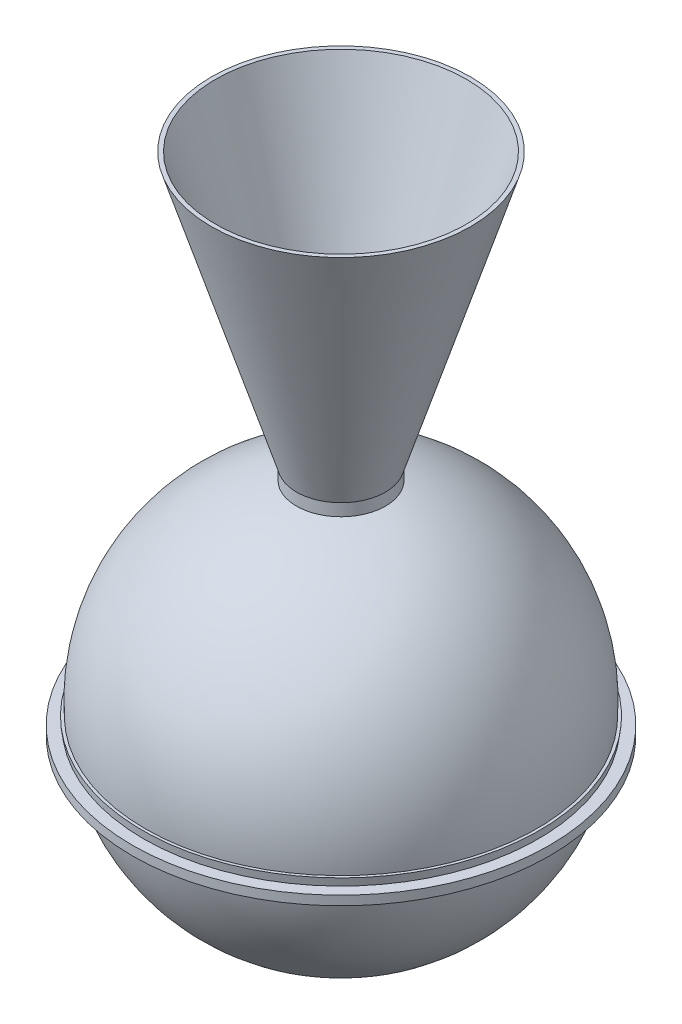
ISO-10303-21;
HEADER;
FILE_DESCRIPTION(('STEP AP214'),'2;1');
FILE_NAME('part.step','',(''),(''),'','','');
FILE_SCHEMA(('AUTOMOTIVE_DESIGN { 1 0 10303 214 1 1 1 1 }'));
ENDSEC;
DATA;
#1=APPLICATION_CONTEXT('core data for automotive mechanical design processes');
#2=APPLICATION_PROTOCOL_DEFINITION('international standard','automotive_design',2000,#1);
#3=PRODUCT_CONTEXT('',#1,'mechanical');
#4=PRODUCT('Part','Part','',(#3));
#5=PRODUCT_RELATED_PRODUCT_CATEGORY('part','',(#4));
#6=PRODUCT_DEFINITION_FORMATION('','',#4);
#7=PRODUCT_DEFINITION_CONTEXT('part definition',#1,'design');
#8=PRODUCT_DEFINITION('design','',#6,#7);
#9=PRODUCT_DEFINITION_SHAPE('','',#8);
#10=(LENGTH_UNIT() NAMED_UNIT(*) SI_UNIT(.MILLI.,.METRE.));
#11=(NAMED_UNIT(*) PLANE_ANGLE_UNIT() SI_UNIT($,.RADIAN.));
#12=(NAMED_UNIT(*) SI_UNIT($,.STERADIAN.) SOLID_ANGLE_UNIT());
#13=UNCERTAINTY_MEASURE_WITH_UNIT(LENGTH_MEASURE(1.E-05),#10,'distance_accuracy_value','');
#14=(GEOMETRIC_REPRESENTATION_CONTEXT(3) GLOBAL_UNCERTAINTY_ASSIGNED_CONTEXT((#13)) GLOBAL_UNIT_ASSIGNED_CONTEXT((#10,
#11,#12)) REPRESENTATION_CONTEXT('',''));
#15=CARTESIAN_POINT('',(0.,0.,0.));
#16=DIRECTION('',(0.,0.,1.));
#17=DIRECTION('',(1.,0.,0.));
#18=AXIS2_PLACEMENT_3D('',#15,#16,#17);
#19=CARTESIAN_POINT('',(0.,259.143054292167,0.));
#20=DIRECTION('',(0.,-1.,0.));
#21=DIRECTION('',(0.,0.,-1.));
#22=AXIS2_PLACEMENT_3D('',#19,#20,#21);
#23=CONICAL_SURFACE('',#22,109.422978505705,1.17688603032807);
#24=CARTESIAN_POINT('',(0.,253.636385117815,0.));
#25=DIRECTION('',(0.,-1.,0.));
#26=DIRECTION('',(0.,0.,-1.));
#27=AXIS2_PLACEMENT_3D('',#24,#25,#26);
#28=CIRCLE('',#27,122.671842712561);
#29=CARTESIAN_POINT('',(0.,253.636385117815,-122.671842712561));
#30=VERTEX_POINT('',#29);
#31=EDGE_CURVE('E137',#30,#30,#28,.T.);
#32=ORIENTED_EDGE('',*,*,#31,.T.);
#33=EDGE_LOOP('',(#32));
#34=FACE_BOUND('',#33,.T.);
#35=CARTESIAN_POINT('',(0.,259.143054292167,0.));
#36=DIRECTION('',(0.,-1.,0.));
#37=DIRECTION('',(0.,0.,-1.));
#38=AXIS2_PLACEMENT_3D('',#35,#36,#37);
#39=CIRCLE('',#38,109.422978505705);
#40=CARTESIAN_POINT('',(0.,259.143054292167,-109.422978505705));
#41=VERTEX_POINT('',#40);
#42=EDGE_CURVE('E10',#41,#41,#39,.T.);
#43=ORIENTED_EDGE('',*,*,#42,.F.);
#44=EDGE_LOOP('',(#43));
#45=FACE_BOUND('',#44,.T.);
#46=ADVANCED_FACE('F31',(#34,#45),#23,.F.);
#47=CARTESIAN_POINT('',(0.,198.887173912595,0.));
#48=DIRECTION('',(0.,-1.,0.));
#49=DIRECTION('',(0.,0.,-1.));
#50=AXIS2_PLACEMENT_3D('',#47,#48,#49);
#51=TOROIDAL_SURFACE('',#50,81.8672808666843,66.2577360969295);
#52=ORIENTED_EDGE('',*,*,#42,.T.);
#53=EDGE_LOOP('',(#52));
#54=FACE_BOUND('',#53,.T.);
#55=CARTESIAN_POINT('',(0.,264.138306117889,0.));
#56=DIRECTION('',(0.,-1.,0.));
#57=DIRECTION('',(0.,0.,-1.));
#58=AXIS2_PLACEMENT_3D('',#55,#56,#57);
#59=CIRCLE('',#58,70.3617457371163);
#60=CARTESIAN_POINT('',(0.,264.138306117889,-70.3617457371163));
#61=VERTEX_POINT('',#60);
#62=EDGE_CURVE('E37',#61,#61,#59,.T.);
#63=ORIENTED_EDGE('',*,*,#62,.F.);
#64=EDGE_LOOP('',(#63));
#65=FACE_BOUND('',#64,.T.);
#66=ADVANCED_FACE('F256',(#54,#65),#51,.F.);
#67=CARTESIAN_POINT('',(0.,298.232610420961,0.));
#68=DIRECTION('',(0.,-1.,0.));
#69=DIRECTION('',(0.,0.,-1.));
#70=AXIS2_PLACEMENT_3D('',#67,#68,#69);
#71=TOROIDAL_SURFACE('',#70,64.35,34.6202639030705);
#72=ORIENTED_EDGE('',*,*,#62,.T.);
#73=EDGE_LOOP('',(#72));
#74=FACE_BOUND('',#73,.T.);
#75=CARTESIAN_POINT('',(0.,326.591870370986,0.));
#76=DIRECTION('',(0.,-1.,0.));
#77=DIRECTION('',(0.,0.,-1.));
#78=AXIS2_PLACEMENT_3D('',#75,#76,#77);
#79=CIRCLE('',#78,44.4926324049439);
#80=CARTESIAN_POINT('',(0.,326.591870370986,-44.4926324049439));
#81=VERTEX_POINT('',#80);
#82=EDGE_CURVE('E41',#81,#81,#79,.T.);
#83=ORIENTED_EDGE('',*,*,#82,.F.);
#84=EDGE_LOOP('',(#83));
#85=FACE_BOUND('',#84,.T.);
#86=ADVANCED_FACE('F260',(#74,#85),#71,.T.);
#87=CARTESIAN_POINT('',(0.,380.867030344746,0.));
#88=DIRECTION('',(0.,-1.,0.));
#89=DIRECTION('',(0.,0.,-1.));
#90=AXIS2_PLACEMENT_3D('',#87,#88,#89);
#91=DEGENERATE_TOROIDAL_SURFACE('',#90,6.48875625377875,66.2577360969295,.T.);
#92=ORIENTED_EDGE('',*,*,#82,.T.);
#93=EDGE_LOOP('',(#92));
#94=FACE_BOUND('',#93,.T.);
#95=CARTESIAN_POINT('',(0.,361.119395631551,0.));
#96=DIRECTION('',(0.,-1.,0.));
#97=DIRECTION('',(0.,0.,-1.));
#98=AXIS2_PLACEMENT_3D('',#95,#96,#97);
#99=CIRCLE('',#98,69.7352464008581);
#100=CARTESIAN_POINT('',(0.,361.119395631551,-69.7352464008581));
#101=VERTEX_POINT('',#100);
#102=EDGE_CURVE('E45',#101,#101,#99,.T.);
#103=ORIENTED_EDGE('',*,*,#102,.F.);
#104=EDGE_LOOP('',(#103));
#105=FACE_BOUND('',#104,.T.);
#106=ADVANCED_FACE('F264',(#94,#105),#91,.F.);
#107=CARTESIAN_POINT('',(0.,698.032610420961,0.));
#108=DIRECTION('',(0.,1.,0.));
#109=DIRECTION('',(0.,0.,1.));
#110=AXIS2_PLACEMENT_3D('',#107,#108,#109);
#111=CONICAL_SURFACE('',#110,184.233675527961,0.327599980999325);
#112=ORIENTED_EDGE('',*,*,#102,.T.);
#113=EDGE_LOOP('',(#112));
#114=FACE_BOUND('',#113,.T.);
#115=CARTESIAN_POINT('',(0.,698.032610420961,0.));
#116=DIRECTION('',(0.,-1.,0.));
#117=DIRECTION('',(0.,0.,-1.));
#118=AXIS2_PLACEMENT_3D('',#115,#116,#117);
#119=CIRCLE('',#118,184.233675527961);
#120=CARTESIAN_POINT('',(0.,698.032610420961,-184.233675527961));
#121=VERTEX_POINT('',#120);
#122=EDGE_CURVE('E50',#121,#121,#119,.T.);
#123=ORIENTED_EDGE('',*,*,#122,.F.);
#124=EDGE_LOOP('',(#123));
#125=FACE_BOUND('',#124,.T.);
#126=ADVANCED_FACE('F270',(#114,#125),#111,.F.);
#127=CARTESIAN_POINT('',(184.95,698.032610420961,0.));
#128=DIRECTION('',(0.,1.,0.));
#129=DIRECTION('',(0.,0.,1.));
#130=AXIS2_PLACEMENT_3D('',#127,#128,#129);
#131=PLANE('',#130);
#132=ORIENTED_EDGE('',*,*,#122,.T.);
#133=EDGE_LOOP('',(#132));
#134=FACE_BOUND('',#133,.T.);
#135=CARTESIAN_POINT('',(0.,698.032610420961,0.));
#136=DIRECTION('',(0.,-1.,0.));
#137=DIRECTION('',(0.,0.,-1.));
#138=AXIS2_PLACEMENT_3D('',#135,#136,#137);
#139=CIRCLE('',#138,190.310109528752);
#140=CARTESIAN_POINT('',(0.,698.032610420961,-190.310109528752));
#141=VERTEX_POINT('',#140);
#142=EDGE_CURVE('E53',#141,#141,#139,.T.);
#143=ORIENTED_EDGE('',*,*,#142,.F.);
#144=EDGE_LOOP('',(#143));
#145=FACE_BOUND('',#144,.T.);
#146=ADVANCED_FACE('F274',(#134,#145),#131,.T.);
#147=CARTESIAN_POINT('',(0.,298.080028718983,0.));
#148=DIRECTION('',(0.,1.,0.));
#149=DIRECTION('',(0.,0.,1.));
#150=AXIS2_PLACEMENT_3D('',#147,#148,#149);
#151=CONICAL_SURFACE('',#150,65.35,0.302827756521468);
#152=ORIENTED_EDGE('',*,*,#142,.T.);
#153=EDGE_LOOP('',(#152));
#154=FACE_BOUND('',#153,.T.);
#155=CARTESIAN_POINT('',(0.,298.080028718983,0.));
#156=DIRECTION('',(0.,-1.,0.));
#157=DIRECTION('',(0.,0.,-1.));
#158=AXIS2_PLACEMENT_3D('',#155,#156,#157);
#159=CIRCLE('',#158,65.35);
#160=CARTESIAN_POINT('',(0.,298.080028718983,-65.35));
#161=VERTEX_POINT('',#160);
#162=EDGE_CURVE('E56',#161,#161,#159,.T.);
#163=ORIENTED_EDGE('',*,*,#162,.F.);
#164=EDGE_LOOP('',(#163));
#165=FACE_BOUND('',#164,.T.);
#166=ADVANCED_FACE('F278',(#154,#165),#151,.T.);
#167=CARTESIAN_POINT('',(0.,-286.742610420961,0.));
#168=DIRECTION('',(0.,-1.,0.));
#169=DIRECTION('',(0.,0.,-1.));
#170=AXIS2_PLACEMENT_3D('',#167,#168,#169);
#171=CYLINDRICAL_SURFACE('',#170,65.35);
#172=ORIENTED_EDGE('',*,*,#162,.T.);
#173=EDGE_LOOP('',(#172));
#174=FACE_BOUND('',#173,.T.);
#175=CARTESIAN_POINT('',(0.,280.223459674362,0.));
#176=DIRECTION('',(0.,-1.,0.));
#177=DIRECTION('',(0.,0.,-1.));
#178=AXIS2_PLACEMENT_3D('',#175,#176,#177);
#179=CIRCLE('',#178,65.35);
#180=CARTESIAN_POINT('',(0.,280.223459674362,-65.35));
#181=VERTEX_POINT('',#180);
#182=EDGE_CURVE('E59',#181,#181,#179,.T.);
#183=ORIENTED_EDGE('',*,*,#182,.F.);
#184=EDGE_LOOP('',(#183));
#185=FACE_BOUND('',#184,.T.);
#186=ADVANCED_FACE('F282',(#174,#185),#171,.T.);
#187=CARTESIAN_POINT('',(0.,0.,0.));
#188=DIRECTION('',(0.,-1.,0.));
#189=DIRECTION('',(1.,0.,0.));
#190=AXIS2_PLACEMENT_3D('',#187,#188,#189);
#191=SPHERICAL_SURFACE('',#190,287.742610420961);
#192=ORIENTED_EDGE('',*,*,#182,.T.);
#193=EDGE_LOOP('',(#192));
#194=FACE_BOUND('',#193,.T.);
#195=CARTESIAN_POINT('',(0.,-19.074610420961,0.));
#196=DIRECTION('',(0.,-1.,0.));
#197=DIRECTION('',(0.,0.,-1.));
#198=AXIS2_PLACEMENT_3D('',#195,#196,#197);
#199=CIRCLE('',#198,287.109681287757);
#200=CARTESIAN_POINT('',(0.,-19.074610420961,-287.109681287757));
#201=VERTEX_POINT('',#200);
#202=EDGE_CURVE('E62',#201,#201,#199,.T.);
#203=ORIENTED_EDGE('',*,*,#202,.F.);
#204=EDGE_LOOP('',(#203));
#205=FACE_BOUND('',#204,.T.);
#206=ADVANCED_FACE('F286',(#194,#205),#191,.T.);
#207=CARTESIAN_POINT('',(286.039043921409,-19.074610420961,0.));
#208=DIRECTION('',(0.,1.,0.));
#209=DIRECTION('',(0.,0.,1.));
#210=AXIS2_PLACEMENT_3D('',#207,#208,#209);
#211=PLANE('',#210);
#212=ORIENTED_EDGE('',*,*,#202,.T.);
#213=EDGE_LOOP('',(#212));
#214=FACE_BOUND('',#213,.T.);
#215=CARTESIAN_POINT('',(0.,-19.074610420961,0.));
#216=DIRECTION('',(0.,-1.,0.));
#217=DIRECTION('',(0.,0.,-1.));
#218=AXIS2_PLACEMENT_3D('',#215,#216,#217);
#219=CIRCLE('',#218,291.179147344789);
#220=CARTESIAN_POINT('',(0.,-19.074610420961,-291.179147344789));
#221=VERTEX_POINT('',#220);
#222=EDGE_CURVE('E65',#221,#221,#219,.T.);
#223=ORIENTED_EDGE('',*,*,#222,.F.);
#224=EDGE_LOOP('',(#223));
#225=FACE_BOUND('',#224,.T.);
#226=ADVANCED_FACE('F290',(#214,#225),#211,.T.);
#227=CARTESIAN_POINT('',(0.,-30.564610420961,0.));
#228=DIRECTION('',(0.,1.,0.));
#229=DIRECTION('',(0.,0.,1.));
#230=AXIS2_PLACEMENT_3D('',#227,#228,#229);
#231=CONICAL_SURFACE('',#230,289.668269710693,0.130744883652687);
#232=ORIENTED_EDGE('',*,*,#222,.T.);
#233=EDGE_LOOP('',(#232));
#234=FACE_BOUND('',#233,.T.);
#235=CARTESIAN_POINT('',(0.,-30.564610420961,0.));
#236=DIRECTION('',(0.,-1.,0.));
#237=DIRECTION('',(0.,0.,-1.));
#238=AXIS2_PLACEMENT_3D('',#235,#236,#237);
#239=CIRCLE('',#238,289.668269710693);
#240=CARTESIAN_POINT('',(0.,-30.564610420961,-289.668269710693));
#241=VERTEX_POINT('',#240);
#242=EDGE_CURVE('E68',#241,#241,#239,.T.);
#243=ORIENTED_EDGE('',*,*,#242,.F.);
#244=EDGE_LOOP('',(#243));
#245=FACE_BOUND('',#244,.T.);
#246=ADVANCED_FACE('F294',(#234,#245),#231,.T.);
#247=CARTESIAN_POINT('',(305.,-30.564610420961,0.));
#248=DIRECTION('',(0.,1.,0.));
#249=DIRECTION('',(0.,0.,1.));
#250=AXIS2_PLACEMENT_3D('',#247,#248,#249);
#251=PLANE('',#250);
#252=ORIENTED_EDGE('',*,*,#242,.T.);
#253=EDGE_LOOP('',(#252));
#254=FACE_BOUND('',#253,.T.);
#255=CARTESIAN_POINT('',(0.,-30.564610420961,0.));
#256=DIRECTION('',(0.,-1.,0.));
#257=DIRECTION('',(0.,0.,-1.));
#258=AXIS2_PLACEMENT_3D('',#255,#256,#257);
#259=CIRCLE('',#258,306.);
#260=CARTESIAN_POINT('',(0.,-30.564610420961,-306.));
#261=VERTEX_POINT('',#260);
#262=EDGE_CURVE('E71',#261,#261,#259,.T.);
#263=ORIENTED_EDGE('',*,*,#262,.F.);
#264=EDGE_LOOP('',(#263));
#265=FACE_BOUND('',#264,.T.);
#266=ADVANCED_FACE('F298',(#254,#265),#251,.T.);
#267=CARTESIAN_POINT('',(0.,-286.742610420961,0.));
#268=DIRECTION('',(0.,-1.,0.));
#269=DIRECTION('',(0.,0.,-1.));
#270=AXIS2_PLACEMENT_3D('',#267,#268,#269);
#271=CYLINDRICAL_SURFACE('',#270,306.);
#272=ORIENTED_EDGE('',*,*,#262,.T.);
#273=EDGE_LOOP('',(#272));
#274=FACE_BOUND('',#273,.T.);
#275=CARTESIAN_POINT('',(0.,-44.064610420961,0.));
#276=DIRECTION('',(0.,-1.,0.));
#277=DIRECTION('',(0.,0.,-1.));
#278=AXIS2_PLACEMENT_3D('',#275,#276,#277);
#279=CIRCLE('',#278,306.);
#280=CARTESIAN_POINT('',(0.,-44.064610420961,-306.));
#281=VERTEX_POINT('',#280);
#282=EDGE_CURVE('E74',#281,#281,#279,.T.);
#283=ORIENTED_EDGE('',*,*,#282,.F.);
#284=EDGE_LOOP('',(#283));
#285=FACE_BOUND('',#284,.T.);
#286=ADVANCED_FACE('F302',(#274,#285),#271,.T.);
#287=CARTESIAN_POINT('',(287.015973703144,-44.064610420961,0.));
#288=DIRECTION('',(0.,-1.,0.));
#289=DIRECTION('',(0.,0.,-1.));
#290=AXIS2_PLACEMENT_3D('',#287,#288,#289);
#291=PLANE('',#290);
#292=ORIENTED_EDGE('',*,*,#282,.T.);
#293=EDGE_LOOP('',(#292));
#294=FACE_BOUND('',#293,.T.);
#295=CARTESIAN_POINT('',(0.,-44.064610420961,0.));
#296=DIRECTION('',(0.,-1.,0.));
#297=DIRECTION('',(0.,0.,-1.));
#298=AXIS2_PLACEMENT_3D('',#295,#296,#297);
#299=CIRCLE('',#298,287.893087111886);
#300=CARTESIAN_POINT('',(0.,-44.064610420961,-287.893087111886));
#301=VERTEX_POINT('',#300);
#302=EDGE_CURVE('E77',#301,#301,#299,.T.);
#303=ORIENTED_EDGE('',*,*,#302,.F.);
#304=EDGE_LOOP('',(#303));
#305=FACE_BOUND('',#304,.T.);
#306=ADVANCED_FACE('F306',(#294,#305),#291,.T.);
#307=CARTESIAN_POINT('',(0.,-55.554610420961,0.));
#308=DIRECTION('',(0.,1.,0.));
#309=DIRECTION('',(0.,0.,1.));
#310=AXIS2_PLACEMENT_3D('',#307,#308,#309);
#311=CONICAL_SURFACE('',#310,286.382209477791,0.130744883652687);
#312=ORIENTED_EDGE('',*,*,#302,.T.);
#313=EDGE_LOOP('',(#312));
#314=FACE_BOUND('',#313,.T.);
#315=CARTESIAN_POINT('',(0.,-55.554610420961,0.));
#316=DIRECTION('',(0.,-1.,0.));
#317=DIRECTION('',(0.,0.,-1.));
#318=AXIS2_PLACEMENT_3D('',#315,#316,#317);
#319=CIRCLE('',#318,286.382209477791);
#320=CARTESIAN_POINT('',(0.,-55.554610420961,-286.382209477791));
#321=VERTEX_POINT('',#320);
#322=EDGE_CURVE('E80',#321,#321,#319,.T.);
#323=ORIENTED_EDGE('',*,*,#322,.F.);
#324=EDGE_LOOP('',(#323));
#325=FACE_BOUND('',#324,.T.);
#326=ADVANCED_FACE('F310',(#314,#325),#311,.T.);
#327=CARTESIAN_POINT('',(281.505096069048,-55.554610420961,0.));
#328=DIRECTION('',(0.,-1.,0.));
#329=DIRECTION('',(0.,0.,-1.));
#330=AXIS2_PLACEMENT_3D('',#327,#328,#329);
#331=PLANE('',#330);
#332=ORIENTED_EDGE('',*,*,#322,.T.);
#333=EDGE_LOOP('',(#332));
#334=FACE_BOUND('',#333,.T.);
#335=CARTESIAN_POINT('',(0.,-55.554610420961,0.));
#336=DIRECTION('',(0.,-1.,0.));
#337=DIRECTION('',(0.,0.,-1.));
#338=AXIS2_PLACEMENT_3D('',#335,#336,#337);
#339=CIRCLE('',#338,282.328700476668);
#340=CARTESIAN_POINT('',(0.,-55.554610420961,-282.328700476668));
#341=VERTEX_POINT('',#340);
#342=EDGE_CURVE('E83',#341,#341,#339,.T.);
#343=ORIENTED_EDGE('',*,*,#342,.F.);
#344=EDGE_LOOP('',(#343));
#345=FACE_BOUND('',#344,.T.);
#346=ADVANCED_FACE('F252',(#334,#345),#331,.T.);
#347=CARTESIAN_POINT('',(0.,0.,0.));
#348=DIRECTION('',(0.,-1.,0.));
#349=DIRECTION('',(-1.,0.,0.));
#350=AXIS2_PLACEMENT_3D('',#347,#348,#349);
#351=SPHERICAL_SURFACE('',#350,287.742610420961);
#352=ORIENTED_EDGE('',*,*,#342,.T.);
#353=EDGE_LOOP('',(#352));
#354=FACE_BOUND('',#353,.T.);
#355=ADVANCED_FACE('F247',(#354),#351,.T.);
#356=CARTESIAN_POINT('',(0.,0.,0.));
#357=DIRECTION('',(0.,-1.,0.));
#358=DIRECTION('',(-1.,0.,0.));
#359=AXIS2_PLACEMENT_3D('',#356,#357,#358);
#360=SPHERICAL_SURFACE('',#359,286.742610420961);
#361=CARTESIAN_POINT('',(0.,-54.5546104209611,0.));
#362=DIRECTION('',(0.,-1.,0.));
#363=DIRECTION('',(0.,0.,-1.));
#364=AXIS2_PLACEMENT_3D('',#361,#362,#363);
#365=CIRCLE('',#364,281.505096069048);
#366=CARTESIAN_POINT('',(0.,-54.5546104209611,-281.505096069048));
#367=VERTEX_POINT('',#366);
#368=EDGE_CURVE('E86',#367,#367,#365,.T.);
#369=ORIENTED_EDGE('',*,*,#368,.F.);
#370=EDGE_LOOP('',(#369));
#371=FACE_BOUND('',#370,.T.);
#372=ADVANCED_FACE('F242',(#371),#360,.F.);
#373=CARTESIAN_POINT('',(281.505096069048,-54.5546104209611,0.));
#374=DIRECTION('',(0.,-1.,0.));
#375=DIRECTION('',(0.,0.,-1.));
#376=AXIS2_PLACEMENT_3D('',#373,#374,#375);
#377=PLANE('',#376);
#378=CARTESIAN_POINT('',(0.,-54.554610420961,0.));
#379=DIRECTION('',(0.,-1.,0.));
#380=DIRECTION('',(0.,0.,-1.));
#381=AXIS2_PLACEMENT_3D('',#378,#379,#380);
#382=CIRCLE('',#381,285.505096069048);
#383=CARTESIAN_POINT('',(0.,-54.554610420961,-285.505096069048));
#384=VERTEX_POINT('',#383);
#385=EDGE_CURVE('E89',#384,#384,#382,.T.);
#386=ORIENTED_EDGE('',*,*,#385,.F.);
#387=EDGE_LOOP('',(#386));
#388=FACE_BOUND('',#387,.T.);
#389=ORIENTED_EDGE('',*,*,#368,.T.);
#390=EDGE_LOOP('',(#389));
#391=FACE_BOUND('',#390,.T.);
#392=ADVANCED_FACE('F236',(#388,#391),#377,.F.);
#393=CARTESIAN_POINT('',(0.,-54.554610420961,0.));
#394=DIRECTION('',(0.,1.,0.));
#395=DIRECTION('',(0.,0.,1.));
#396=AXIS2_PLACEMENT_3D('',#393,#394,#395);
#397=CONICAL_SURFACE('',#396,285.505096069048,0.130744883652687);
#398=CARTESIAN_POINT('',(0.,-43.064610420961,0.));
#399=DIRECTION('',(0.,-1.,0.));
#400=DIRECTION('',(0.,0.,-1.));
#401=AXIS2_PLACEMENT_3D('',#398,#399,#400);
#402=CIRCLE('',#401,287.015973703144);
#403=CARTESIAN_POINT('',(0.,-43.064610420961,-287.015973703144));
#404=VERTEX_POINT('',#403);
#405=EDGE_CURVE('E92',#404,#404,#402,.T.);
#406=ORIENTED_EDGE('',*,*,#405,.F.);
#407=EDGE_LOOP('',(#406));
#408=FACE_BOUND('',#407,.T.);
#409=ORIENTED_EDGE('',*,*,#385,.T.);
#410=EDGE_LOOP('',(#409));
#411=FACE_BOUND('',#410,.T.);
#412=ADVANCED_FACE('F230',(#408,#411),#397,.F.);
#413=CARTESIAN_POINT('',(287.015973703144,-43.064610420961,0.));
#414=DIRECTION('',(0.,-1.,0.));
#415=DIRECTION('',(0.,0.,-1.));
#416=AXIS2_PLACEMENT_3D('',#413,#414,#415);
#417=PLANE('',#416);
#418=CARTESIAN_POINT('',(0.,-43.064610420961,0.));
#419=DIRECTION('',(0.,-1.,0.));
#420=DIRECTION('',(0.,0.,-1.));
#421=AXIS2_PLACEMENT_3D('',#418,#419,#420);
#422=CIRCLE('',#421,305.);
#423=CARTESIAN_POINT('',(0.,-43.064610420961,-305.));
#424=VERTEX_POINT('',#423);
#425=EDGE_CURVE('E95',#424,#424,#422,.T.);
#426=ORIENTED_EDGE('',*,*,#425,.F.);
#427=EDGE_LOOP('',(#426));
#428=FACE_BOUND('',#427,.T.);
#429=ORIENTED_EDGE('',*,*,#405,.T.);
#430=EDGE_LOOP('',(#429));
#431=FACE_BOUND('',#430,.T.);
#432=ADVANCED_FACE('F224',(#428,#431),#417,.F.);
#433=CARTESIAN_POINT('',(0.,-286.742610420961,0.));
#434=DIRECTION('',(0.,-1.,0.));
#435=DIRECTION('',(0.,0.,-1.));
#436=AXIS2_PLACEMENT_3D('',#433,#434,#435);
#437=CYLINDRICAL_SURFACE('',#436,305.);
#438=CARTESIAN_POINT('',(0.,-31.564610420961,0.));
#439=DIRECTION('',(0.,-1.,0.));
#440=DIRECTION('',(0.,0.,-1.));
#441=AXIS2_PLACEMENT_3D('',#438,#439,#440);
#442=CIRCLE('',#441,305.);
#443=CARTESIAN_POINT('',(0.,-31.564610420961,-305.));
#444=VERTEX_POINT('',#443);
#445=EDGE_CURVE('E98',#444,#444,#442,.T.);
#446=ORIENTED_EDGE('',*,*,#445,.F.);
#447=EDGE_LOOP('',(#446));
#448=FACE_BOUND('',#447,.T.);
#449=ORIENTED_EDGE('',*,*,#425,.T.);
#450=EDGE_LOOP('',(#449));
#451=FACE_BOUND('',#450,.T.);
#452=ADVANCED_FACE('F218',(#448,#451),#437,.F.);
#453=CARTESIAN_POINT('',(305.,-31.564610420961,0.));
#454=DIRECTION('',(0.,1.,0.));
#455=DIRECTION('',(0.,0.,1.));
#456=AXIS2_PLACEMENT_3D('',#453,#454,#455);
#457=PLANE('',#456);
#458=CARTESIAN_POINT('',(0.,-31.564610420961,0.));
#459=DIRECTION('',(0.,-1.,0.));
#460=DIRECTION('',(0.,0.,-1.));
#461=AXIS2_PLACEMENT_3D('',#458,#459,#460);
#462=CIRCLE('',#461,288.528166287313);
#463=CARTESIAN_POINT('',(0.,-31.564610420961,-288.528166287313));
#464=VERTEX_POINT('',#463);
#465=EDGE_CURVE('E101',#464,#464,#462,.T.);
#466=ORIENTED_EDGE('',*,*,#465,.F.);
#467=EDGE_LOOP('',(#466));
#468=FACE_BOUND('',#467,.T.);
#469=ORIENTED_EDGE('',*,*,#445,.T.);
#470=EDGE_LOOP('',(#469));
#471=FACE_BOUND('',#470,.T.);
#472=ADVANCED_FACE('F212',(#468,#471),#457,.F.);
#473=CARTESIAN_POINT('',(0.,-31.564610420961,0.));
#474=DIRECTION('',(0.,1.,0.));
#475=DIRECTION('',(0.,0.,1.));
#476=AXIS2_PLACEMENT_3D('',#473,#474,#475);
#477=CONICAL_SURFACE('',#476,288.528166287313,0.130744883652687);
#478=CARTESIAN_POINT('',(0.,-20.074610420961,0.));
#479=DIRECTION('',(0.,-1.,0.));
#480=DIRECTION('',(0.,0.,-1.));
#481=AXIS2_PLACEMENT_3D('',#478,#479,#480);
#482=CIRCLE('',#481,290.039043921409);
#483=CARTESIAN_POINT('',(0.,-20.074610420961,-290.039043921409));
#484=VERTEX_POINT('',#483);
#485=EDGE_CURVE('E104',#484,#484,#482,.T.);
#486=ORIENTED_EDGE('',*,*,#485,.F.);
#487=EDGE_LOOP('',(#486));
#488=FACE_BOUND('',#487,.T.);
#489=ORIENTED_EDGE('',*,*,#465,.T.);
#490=EDGE_LOOP('',(#489));
#491=FACE_BOUND('',#490,.T.);
#492=ADVANCED_FACE('F206',(#488,#491),#477,.F.);
#493=CARTESIAN_POINT('',(286.039043921409,-20.074610420961,0.));
#494=DIRECTION('',(0.,1.,0.));
#495=DIRECTION('',(0.,0.,1.));
#496=AXIS2_PLACEMENT_3D('',#493,#494,#495);
#497=PLANE('',#496);
#498=CARTESIAN_POINT('',(0.,-20.074610420961,0.));
#499=DIRECTION('',(0.,-1.,0.));
#500=DIRECTION('',(0.,0.,-1.));
#501=AXIS2_PLACEMENT_3D('',#498,#499,#500);
#502=CIRCLE('',#501,286.039043921409);
#503=CARTESIAN_POINT('',(0.,-20.074610420961,-286.039043921409));
#504=VERTEX_POINT('',#503);
#505=EDGE_CURVE('E107',#504,#504,#502,.T.);
#506=ORIENTED_EDGE('',*,*,#505,.F.);
#507=EDGE_LOOP('',(#506));
#508=FACE_BOUND('',#507,.T.);
#509=ORIENTED_EDGE('',*,*,#485,.T.);
#510=EDGE_LOOP('',(#509));
#511=FACE_BOUND('',#510,.T.);
#512=ADVANCED_FACE('F200',(#508,#511),#497,.F.);
#513=CARTESIAN_POINT('',(0.,0.,0.));
#514=DIRECTION('',(0.,-1.,0.));
#515=DIRECTION('',(1.,0.,0.));
#516=AXIS2_PLACEMENT_3D('',#513,#514,#515);
#517=SPHERICAL_SURFACE('',#516,286.742610420961);
#518=CARTESIAN_POINT('',(0.,279.428706705354,0.));
#519=DIRECTION('',(0.,-1.,0.));
#520=DIRECTION('',(0.,0.,-1.));
#521=AXIS2_PLACEMENT_3D('',#518,#519,#520);
#522=CIRCLE('',#521,64.35);
#523=CARTESIAN_POINT('',(0.,279.428706705354,-64.35));
#524=VERTEX_POINT('',#523);
#525=EDGE_CURVE('E110',#524,#524,#522,.T.);
#526=ORIENTED_EDGE('',*,*,#525,.F.);
#527=EDGE_LOOP('',(#526));
#528=FACE_BOUND('',#527,.T.);
#529=ORIENTED_EDGE('',*,*,#505,.T.);
#530=EDGE_LOOP('',(#529));
#531=FACE_BOUND('',#530,.T.);
#532=ADVANCED_FACE('F194',(#528,#531),#517,.F.);
#533=CARTESIAN_POINT('',(0.,-286.742610420961,0.));
#534=DIRECTION('',(0.,-1.,0.));
#535=DIRECTION('',(0.,0.,-1.));
#536=AXIS2_PLACEMENT_3D('',#533,#534,#535);
#537=CYLINDRICAL_SURFACE('',#536,64.35);
#538=CARTESIAN_POINT('',(0.,298.232610420961,0.));
#539=DIRECTION('',(0.,-1.,0.));
#540=DIRECTION('',(0.,0.,-1.));
#541=AXIS2_PLACEMENT_3D('',#538,#539,#540);
#542=CIRCLE('',#541,64.35);
#543=CARTESIAN_POINT('',(0.,298.232610420961,-64.35));
#544=VERTEX_POINT('',#543);
#545=EDGE_CURVE('E113',#544,#544,#542,.T.);
#546=ORIENTED_EDGE('',*,*,#545,.F.);
#547=EDGE_LOOP('',(#546));
#548=FACE_BOUND('',#547,.T.);
#549=ORIENTED_EDGE('',*,*,#525,.T.);
#550=EDGE_LOOP('',(#549));
#551=FACE_BOUND('',#550,.T.);
#552=ADVANCED_FACE('F188',(#548,#551),#537,.F.);
#553=CARTESIAN_POINT('',(0.,298.232610420961,0.));
#554=DIRECTION('',(0.,1.,0.));
#555=DIRECTION('',(0.,0.,1.));
#556=AXIS2_PLACEMENT_3D('',#553,#554,#555);
#557=CONICAL_SURFACE('',#556,64.35,0.302827756521468);
#558=CARTESIAN_POINT('',(0.,697.032610420961,0.));
#559=DIRECTION('',(0.,-1.,0.));
#560=DIRECTION('',(0.,0.,-1.));
#561=AXIS2_PLACEMENT_3D('',#558,#559,#560);
#562=CIRCLE('',#561,188.95);
#563=CARTESIAN_POINT('',(0.,697.032610420961,-188.95));
#564=VERTEX_POINT('',#563);
#565=EDGE_CURVE('E116',#564,#564,#562,.T.);
#566=ORIENTED_EDGE('',*,*,#565,.F.);
#567=EDGE_LOOP('',(#566));
#568=FACE_BOUND('',#567,.T.);
#569=ORIENTED_EDGE('',*,*,#545,.T.);
#570=EDGE_LOOP('',(#569));
#571=FACE_BOUND('',#570,.T.);
#572=ADVANCED_FACE('F182',(#568,#571),#557,.F.);
#573=CARTESIAN_POINT('',(184.95,697.032610420961,0.));
#574=DIRECTION('',(0.,1.,0.));
#575=DIRECTION('',(0.,0.,1.));
#576=AXIS2_PLACEMENT_3D('',#573,#574,#575);
#577=PLANE('',#576);
#578=CARTESIAN_POINT('',(0.,697.032610420961,0.));
#579=DIRECTION('',(0.,-1.,0.));
#580=DIRECTION('',(0.,0.,-1.));
#581=AXIS2_PLACEMENT_3D('',#578,#579,#580);
#582=CIRCLE('',#581,184.95);
#583=CARTESIAN_POINT('',(0.,697.032610420961,-184.95));
#584=VERTEX_POINT('',#583);
#585=EDGE_CURVE('E119',#584,#584,#582,.T.);
#586=ORIENTED_EDGE('',*,*,#585,.F.);
#587=EDGE_LOOP('',(#586));
#588=FACE_BOUND('',#587,.T.);
#589=ORIENTED_EDGE('',*,*,#565,.T.);
#590=EDGE_LOOP('',(#589));
#591=FACE_BOUND('',#590,.T.);
#592=ADVANCED_FACE('F176',(#588,#591),#577,.F.);
#593=CARTESIAN_POINT('',(0.,697.032610420961,0.));
#594=DIRECTION('',(0.,1.,0.));
#595=DIRECTION('',(0.,0.,1.));
#596=AXIS2_PLACEMENT_3D('',#593,#594,#595);
#597=CONICAL_SURFACE('',#596,184.95,0.327599980999325);
#598=CARTESIAN_POINT('',(0.,360.809395966637,0.));
#599=DIRECTION('',(0.,-1.,0.));
#600=DIRECTION('',(0.,0.,-1.));
#601=AXIS2_PLACEMENT_3D('',#598,#599,#600);
#602=CIRCLE('',#601,70.6860643596357);
#603=CARTESIAN_POINT('',(0.,360.809395966637,-70.6860643596357));
#604=VERTEX_POINT('',#603);
#605=EDGE_CURVE('E122',#604,#604,#602,.T.);
#606=ORIENTED_EDGE('',*,*,#605,.F.);
#607=EDGE_LOOP('',(#606));
#608=FACE_BOUND('',#607,.T.);
#609=ORIENTED_EDGE('',*,*,#585,.T.);
#610=EDGE_LOOP('',(#609));
#611=FACE_BOUND('',#610,.T.);
#612=ADVANCED_FACE('F170',(#608,#611),#597,.T.);
#613=CARTESIAN_POINT('',(0.,380.867030344746,0.));
#614=DIRECTION('',(0.,-1.,0.));
#615=DIRECTION('',(0.,0.,-1.));
#616=AXIS2_PLACEMENT_3D('',#613,#614,#615);
#617=DEGENERATE_TOROIDAL_SURFACE('',#616,6.48875625377875,67.2577360969295,.T.);
#618=CARTESIAN_POINT('',(0.,325.772718326696,0.));
#619=DIRECTION('',(0.,-1.,0.));
#620=DIRECTION('',(0.,0.,-1.));
#621=AXIS2_PLACEMENT_3D('',#618,#619,#620);
#622=CIRCLE('',#621,45.066208841295);
#623=CARTESIAN_POINT('',(0.,325.772718326696,-45.066208841295));
#624=VERTEX_POINT('',#623);
#625=EDGE_CURVE('E125',#624,#624,#622,.T.);
#626=ORIENTED_EDGE('',*,*,#625,.F.);
#627=EDGE_LOOP('',(#626));
#628=FACE_BOUND('',#627,.T.);
#629=ORIENTED_EDGE('',*,*,#605,.T.);
#630=EDGE_LOOP('',(#629));
#631=FACE_BOUND('',#630,.T.);
#632=ADVANCED_FACE('F164',(#628,#631),#617,.T.);
#633=CARTESIAN_POINT('',(0.,298.232610420961,0.));
#634=DIRECTION('',(0.,-1.,0.));
#635=DIRECTION('',(0.,0.,-1.));
#636=AXIS2_PLACEMENT_3D('',#633,#634,#635);
#637=TOROIDAL_SURFACE('',#636,64.35,33.6202639030705);
#638=CARTESIAN_POINT('',(0.,265.123113870901,0.));
#639=DIRECTION('',(0.,-1.,0.));
#640=DIRECTION('',(0.,0.,-1.));
#641=AXIS2_PLACEMENT_3D('',#638,#639,#640);
#642=CIRCLE('',#641,70.1880975594493);
#643=CARTESIAN_POINT('',(0.,265.123113870901,-70.1880975594493));
#644=VERTEX_POINT('',#643);
#645=EDGE_CURVE('E128',#644,#644,#642,.T.);
#646=ORIENTED_EDGE('',*,*,#645,.F.);
#647=EDGE_LOOP('',(#646));
#648=FACE_BOUND('',#647,.T.);
#649=ORIENTED_EDGE('',*,*,#625,.T.);
#650=EDGE_LOOP('',(#649));
#651=FACE_BOUND('',#650,.T.);
#652=ADVANCED_FACE('F158',(#648,#651),#637,.F.);
#653=CARTESIAN_POINT('',(0.,198.887173912595,0.));
#654=DIRECTION('',(0.,-1.,0.));
#655=DIRECTION('',(0.,0.,-1.));
#656=AXIS2_PLACEMENT_3D('',#653,#654,#655);
#657=TOROIDAL_SURFACE('',#656,81.8672808666843,67.2577360969295);
#658=CARTESIAN_POINT('',(0.,260.059776219912,0.));
#659=DIRECTION('',(0.,-1.,0.));
#660=DIRECTION('',(0.,0.,-1.));
#661=AXIS2_PLACEMENT_3D('',#658,#659,#660);
#662=CIRCLE('',#661,109.822884809992);
#663=CARTESIAN_POINT('',(0.,260.059776219912,-109.822884809992));
#664=VERTEX_POINT('',#663);
#665=EDGE_CURVE('E131',#664,#664,#662,.T.);
#666=ORIENTED_EDGE('',*,*,#665,.F.);
#667=EDGE_LOOP('',(#666));
#668=FACE_BOUND('',#667,.T.);
#669=ORIENTED_EDGE('',*,*,#645,.T.);
#670=EDGE_LOOP('',(#669));
#671=FACE_BOUND('',#670,.T.);
#672=ADVANCED_FACE('F152',(#668,#671),#657,.T.);
#673=CARTESIAN_POINT('',(0.,260.059776219912,0.));
#674=DIRECTION('',(0.,-1.,0.));
#675=DIRECTION('',(0.,0.,-1.));
#676=AXIS2_PLACEMENT_3D('',#673,#674,#675);
#677=CONICAL_SURFACE('',#676,109.822884809992,1.17688603032807);
#678=CARTESIAN_POINT('',(0.,254.55980046093,0.));
#679=DIRECTION('',(0.,-1.,0.));
#680=DIRECTION('',(0.,0.,-1.));
#681=AXIS2_PLACEMENT_3D('',#678,#679,#680);
#682=CIRCLE('',#681,123.055644880481);
#683=CARTESIAN_POINT('',(0.,254.55980046093,-123.055644880481));
#684=VERTEX_POINT('',#683);
#685=EDGE_CURVE('E134',#684,#684,#682,.T.);
#686=ORIENTED_EDGE('',*,*,#685,.F.);
#687=EDGE_LOOP('',(#686));
#688=FACE_BOUND('',#687,.T.);
#689=ORIENTED_EDGE('',*,*,#665,.T.);
#690=EDGE_LOOP('',(#689));
#691=FACE_BOUND('',#690,.T.);
#692=ADVANCED_FACE('F146',(#688,#691),#677,.T.);
#693=CARTESIAN_POINT('',(0.,254.55980046093,0.));
#694=DIRECTION('',(0.,1.,0.));
#695=DIRECTION('',(0.,0.,1.));
#696=AXIS2_PLACEMENT_3D('',#693,#694,#695);
#697=CONICAL_SURFACE('',#696,123.055644880481,0.393910296466823);
#698=ORIENTED_EDGE('',*,*,#31,.F.);
#699=EDGE_LOOP('',(#698));
#700=FACE_BOUND('',#699,.T.);
#701=ORIENTED_EDGE('',*,*,#685,.T.);
#702=EDGE_LOOP('',(#701));
#703=FACE_BOUND('',#702,.T.);
#704=ADVANCED_FACE('F143',(#700,#703),#697,.T.);
#705=CLOSED_SHELL('',(#46,#66,#86,#106,#126,#146,#166,#186,#206,#226,#246,#266,#286,#306,#326,
#346,#355,#372,#392,#412,#432,#452,#472,#492,#512,#532,#552,#572,#592,#612,#632,#652,#672,#692,#704));
#706=MANIFOLD_SOLID_BREP('B2',#705);
#707=ADVANCED_BREP_SHAPE_REPRESENTATION('',(#18,#706),#14);
#708=SHAPE_DEFINITION_REPRESENTATION(#9,#707);
ENDSEC;
END-ISO-10303-21;
